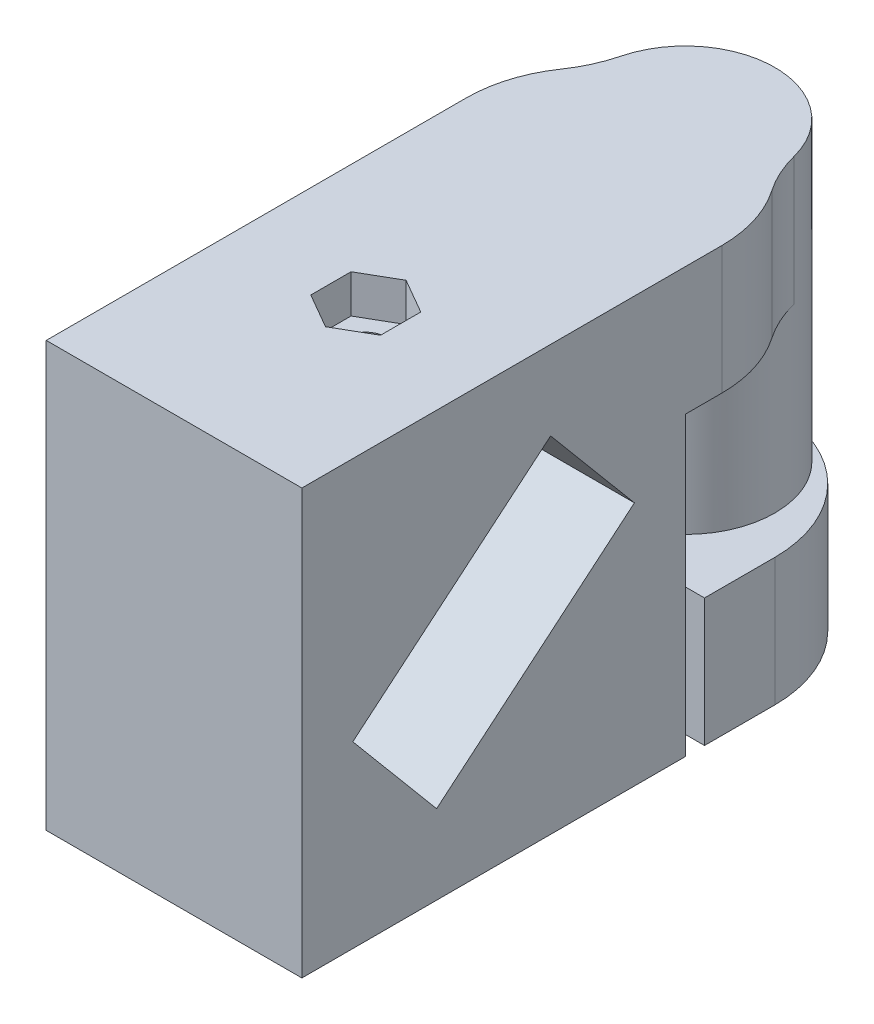
ISO-10303-21;
HEADER;
FILE_DESCRIPTION(('STEP AP214'),'2;1');
FILE_NAME('part.step','',(''),(''),'','','');
FILE_SCHEMA(('AUTOMOTIVE_DESIGN { 1 0 10303 214 1 1 1 1 }'));
ENDSEC;
DATA;
#1=APPLICATION_CONTEXT('core data for automotive mechanical design processes');
#2=APPLICATION_PROTOCOL_DEFINITION('international standard','automotive_design',2000,#1);
#3=PRODUCT_CONTEXT('',#1,'mechanical');
#4=PRODUCT('Part','Part','',(#3));
#5=PRODUCT_RELATED_PRODUCT_CATEGORY('part','',(#4));
#6=PRODUCT_DEFINITION_FORMATION('','',#4);
#7=PRODUCT_DEFINITION_CONTEXT('part definition',#1,'design');
#8=PRODUCT_DEFINITION('design','',#6,#7);
#9=PRODUCT_DEFINITION_SHAPE('','',#8);
#10=(LENGTH_UNIT() NAMED_UNIT(*) SI_UNIT(.MILLI.,.METRE.));
#11=(NAMED_UNIT(*) PLANE_ANGLE_UNIT() SI_UNIT($,.RADIAN.));
#12=(NAMED_UNIT(*) SI_UNIT($,.STERADIAN.) SOLID_ANGLE_UNIT());
#13=UNCERTAINTY_MEASURE_WITH_UNIT(LENGTH_MEASURE(1.E-05),#10,'distance_accuracy_value','');
#14=(GEOMETRIC_REPRESENTATION_CONTEXT(3) GLOBAL_UNCERTAINTY_ASSIGNED_CONTEXT((#13)) GLOBAL_UNIT_ASSIGNED_CONTEXT((#10,
#11,#12)) REPRESENTATION_CONTEXT('',''));
#15=CARTESIAN_POINT('',(0.,0.,0.));
#16=DIRECTION('',(0.,0.,1.));
#17=DIRECTION('',(1.,0.,0.));
#18=AXIS2_PLACEMENT_3D('',#15,#16,#17);
#19=CARTESIAN_POINT('',(0.,0.,0.));
#20=DIRECTION('',(0.,1.,0.));
#21=DIRECTION('',(0.,0.,1.));
#22=AXIS2_PLACEMENT_3D('',#19,#20,#21);
#23=CYLINDRICAL_SURFACE('',#22,1.5);
#24=CARTESIAN_POINT('',(0.,23.2575771755946,0.));
#25=DIRECTION('',(0.,0.766044443118977,0.64278760968654));
#26=DIRECTION('',(0.,0.64278760968654,-0.766044443118977));
#27=AXIS2_PLACEMENT_3D('',#24,#25,#26);
#28=ELLIPSE('',#27,1.95811093399842,1.5);
#29=CARTESIAN_POINT('',(0.,24.5162266223606,-1.5));
#30=VERTEX_POINT('',#29);
#31=EDGE_CURVE('E314',#30,#30,#28,.F.);
#32=ORIENTED_EDGE('',*,*,#31,.T.);
#33=EDGE_LOOP('',(#32));
#34=FACE_BOUND('',#33,.T.);
#35=CARTESIAN_POINT('',(0.,30.2,0.));
#36=DIRECTION('',(0.,1.,0.));
#37=DIRECTION('',(0.,0.,1.));
#38=AXIS2_PLACEMENT_3D('',#35,#36,#37);
#39=CIRCLE('',#38,1.5);
#40=CARTESIAN_POINT('',(0.,30.2,1.5));
#41=VERTEX_POINT('',#40);
#42=EDGE_CURVE('E38',#41,#41,#39,.F.);
#43=ORIENTED_EDGE('',*,*,#42,.F.);
#44=EDGE_LOOP('',(#43));
#45=FACE_BOUND('',#44,.T.);
#46=ADVANCED_FACE('F34',(#34,#45),#23,.F.);
#47=CARTESIAN_POINT('',(0.,9.94242282440537,0.));
#48=DIRECTION('',(0.,-0.766044443118977,-0.64278760968654));
#49=DIRECTION('',(0.,0.64278760968654,-0.766044443118977));
#50=AXIS2_PLACEMENT_3D('',#47,#48,#49);
#51=ELLIPSE('',#50,1.95811093399842,1.5);
#52=CARTESIAN_POINT('',(0.,11.2010722711713,-1.5));
#53=VERTEX_POINT('',#52);
#54=EDGE_CURVE('E324',#53,#53,#51,.F.);
#55=ORIENTED_EDGE('',*,*,#54,.T.);
#56=EDGE_LOOP('',(#55));
#57=FACE_BOUND('',#56,.T.);
#58=CARTESIAN_POINT('',(0.,3.,0.));
#59=DIRECTION('',(0.,-1.,0.));
#60=DIRECTION('',(0.,0.,-1.));
#61=AXIS2_PLACEMENT_3D('',#58,#59,#60);
#62=CIRCLE('',#61,1.5);
#63=CARTESIAN_POINT('',(0.,3.,-1.5));
#64=VERTEX_POINT('',#63);
#65=EDGE_CURVE('E263',#64,#64,#62,.F.);
#66=ORIENTED_EDGE('',*,*,#65,.F.);
#67=EDGE_LOOP('',(#66));
#68=FACE_BOUND('',#67,.T.);
#69=ADVANCED_FACE('F415',(#57,#68),#23,.F.);
#70=CARTESIAN_POINT('',(-10.,33.2,-15.));
#71=DIRECTION('',(0.,0.,1.));
#72=DIRECTION('',(1.,0.,0.));
#73=AXIS2_PLACEMENT_3D('',#70,#71,#72);
#74=PLANE('',#73);
#75=DIRECTION('',(-1.,0.,0.));
#76=VECTOR('',#75,1.);
#77=CARTESIAN_POINT('',(10.,23.2,-15.));
#78=LINE('',#77,#76);
#79=CARTESIAN_POINT('',(10.,23.2,-15.));
#80=VERTEX_POINT('',#79);
#81=CARTESIAN_POINT('',(-10.,23.2,-15.));
#82=VERTEX_POINT('',#81);
#83=EDGE_CURVE('E293',#80,#82,#78,.T.);
#84=ORIENTED_EDGE('',*,*,#83,.F.);
#85=DIRECTION('',(0.,-1.,0.));
#86=VECTOR('',#85,1.);
#87=CARTESIAN_POINT('',(10.,33.2,-15.));
#88=LINE('',#87,#86);
#89=CARTESIAN_POINT('',(10.,0.,-15.));
#90=VERTEX_POINT('',#89);
#91=EDGE_CURVE('E359',#80,#90,#88,.T.);
#92=ORIENTED_EDGE('',*,*,#91,.T.);
#93=DIRECTION('',(-1.,0.,0.));
#94=VECTOR('',#93,1.);
#95=CARTESIAN_POINT('',(-10.,0.,-15.));
#96=LINE('',#95,#94);
#97=CARTESIAN_POINT('',(-10.,0.,-15.));
#98=VERTEX_POINT('',#97);
#99=EDGE_CURVE('E346',#90,#98,#96,.T.);
#100=ORIENTED_EDGE('',*,*,#99,.T.);
#101=DIRECTION('',(0.,-1.,0.));
#102=VECTOR('',#101,1.);
#103=CARTESIAN_POINT('',(-10.,33.2,-15.));
#104=LINE('',#103,#102);
#105=EDGE_CURVE('E357',#82,#98,#104,.T.);
#106=ORIENTED_EDGE('',*,*,#105,.F.);
#107=EDGE_LOOP('',(#84,#92,#100,#106));
#108=FACE_BOUND('',#107,.T.);
#109=ADVANCED_FACE('F417',(#108),#74,.F.);
#110=CARTESIAN_POINT('',(10.,33.2,15.));
#111=DIRECTION('',(-1.,0.,0.));
#112=DIRECTION('',(0.,0.,1.));
#113=AXIS2_PLACEMENT_3D('',#110,#111,#112);
#114=PLANE('',#113);
#115=DIRECTION('',(0.,-0.766044443118977,-0.642787609686541));
#116=VECTOR('',#115,1.);
#117=CARTESIAN_POINT('',(10.,40.2194928800611,6.63449414199771));
#118=LINE('',#117,#116);
#119=CARTESIAN_POINT('',(10.,26.9989815177408,-4.45883206610031));
#120=VERTEX_POINT('',#119);
#121=CARTESIAN_POINT('',(10.,19.1853281979273,-11.015265684903));
#122=VERTEX_POINT('',#121);
#123=EDGE_CURVE('E331',#120,#122,#118,.T.);
#124=ORIENTED_EDGE('',*,*,#123,.T.);
#125=DIRECTION('',(0.,-0.64278760968654,0.766044443118977));
#126=VECTOR('',#125,1.);
#127=CARTESIAN_POINT('',(10.,12.1658353178662,-2.64975982690073));
#128=LINE('',#127,#126);
#129=CARTESIAN_POINT('',(10.,6.20101848225916,4.45883206610031));
#130=VERTEX_POINT('',#129);
#131=EDGE_CURVE('E325',#122,#130,#128,.T.);
#132=ORIENTED_EDGE('',*,*,#131,.T.);
#133=DIRECTION('',(0.,0.766044443118977,0.642787609686541));
#134=VECTOR('',#133,1.);
#135=CARTESIAN_POINT('',(10.,27.235183164393,22.1085918930011));
#136=LINE('',#135,#134);
#137=CARTESIAN_POINT('',(10.,14.0146718020727,11.015265684903));
#138=VERTEX_POINT('',#137);
#139=EDGE_CURVE('E328',#130,#138,#136,.T.);
#140=ORIENTED_EDGE('',*,*,#139,.T.);
#141=DIRECTION('',(0.,0.64278760968654,-0.766044443118977));
#142=VECTOR('',#141,1.);
#143=CARTESIAN_POINT('',(10.,19.9794886376797,3.90667379190198));
#144=LINE('',#143,#142);
#145=EDGE_CURVE('E321',#138,#120,#144,.T.);
#146=ORIENTED_EDGE('',*,*,#145,.T.);
#147=EDGE_LOOP('',(#124,#132,#140,#146));
#148=FACE_BOUND('',#147,.T.);
#149=DIRECTION('',(0.,0.,1.));
#150=VECTOR('',#149,1.);
#151=CARTESIAN_POINT('',(10.,23.2,-25.));
#152=LINE('',#151,#150);
#153=CARTESIAN_POINT('',(10.,23.2,-17.8585715714571));
#154=VERTEX_POINT('',#153);
#155=EDGE_CURVE('E298',#154,#80,#152,.T.);
#156=ORIENTED_EDGE('',*,*,#155,.F.);
#157=DIRECTION('',(0.,1.,0.));
#158=VECTOR('',#157,1.);
#159=CARTESIAN_POINT('',(10.,33.2,-17.8585715714571));
#160=LINE('',#159,#158);
#161=CARTESIAN_POINT('',(10.,33.2,-17.8585715714571));
#162=VERTEX_POINT('',#161);
#163=EDGE_CURVE('E377',#154,#162,#160,.T.);
#164=ORIENTED_EDGE('',*,*,#163,.T.);
#165=DIRECTION('',(0.,0.,-1.));
#166=VECTOR('',#165,1.);
#167=CARTESIAN_POINT('',(10.,33.2,15.));
#168=LINE('',#167,#166);
#169=CARTESIAN_POINT('',(10.,33.2,15.));
#170=VERTEX_POINT('',#169);
#171=EDGE_CURVE('E335',#170,#162,#168,.T.);
#172=ORIENTED_EDGE('',*,*,#171,.F.);
#173=DIRECTION('',(0.,-1.,0.));
#174=VECTOR('',#173,1.);
#175=CARTESIAN_POINT('',(10.,33.2,15.));
#176=LINE('',#175,#174);
#177=CARTESIAN_POINT('',(10.,0.,15.));
#178=VERTEX_POINT('',#177);
#179=EDGE_CURVE('E343',#170,#178,#176,.T.);
#180=ORIENTED_EDGE('',*,*,#179,.T.);
#181=DIRECTION('',(0.,0.,-1.));
#182=VECTOR('',#181,1.);
#183=CARTESIAN_POINT('',(10.,0.,15.));
#184=LINE('',#183,#182);
#185=EDGE_CURVE('E334',#178,#90,#184,.T.);
#186=ORIENTED_EDGE('',*,*,#185,.T.);
#187=ORIENTED_EDGE('',*,*,#91,.F.);
#188=EDGE_LOOP('',(#156,#164,#172,#180,#186,#187));
#189=FACE_BOUND('',#188,.T.);
#190=ADVANCED_FACE('F424',(#148,#189),#114,.F.);
#191=CARTESIAN_POINT('',(-10.,33.2,15.));
#192=DIRECTION('',(1.,0.,0.));
#193=DIRECTION('',(0.,0.,-1.));
#194=AXIS2_PLACEMENT_3D('',#191,#192,#193);
#195=PLANE('',#194);
#196=DIRECTION('',(0.,0.766044443118977,0.642787609686541));
#197=VECTOR('',#196,1.);
#198=CARTESIAN_POINT('',(-10.,14.0146718020727,11.015265684903));
#199=LINE('',#198,#197);
#200=CARTESIAN_POINT('',(-10.,6.20101848225916,4.45883206610032));
#201=VERTEX_POINT('',#200);
#202=CARTESIAN_POINT('',(-10.,14.0146718020727,11.015265684903));
#203=VERTEX_POINT('',#202);
#204=EDGE_CURVE('E302',#201,#203,#199,.T.);
#205=ORIENTED_EDGE('',*,*,#204,.F.);
#206=DIRECTION('',(0.,-0.64278760968654,0.766044443118977));
#207=VECTOR('',#206,1.);
#208=CARTESIAN_POINT('',(-10.,19.1853281979273,-11.015265684903));
#209=LINE('',#208,#207);
#210=CARTESIAN_POINT('',(-10.,19.1853281979273,-11.015265684903));
#211=VERTEX_POINT('',#210);
#212=EDGE_CURVE('E300',#211,#201,#209,.T.);
#213=ORIENTED_EDGE('',*,*,#212,.F.);
#214=DIRECTION('',(0.,-0.766044443118977,-0.642787609686541));
#215=VECTOR('',#214,1.);
#216=CARTESIAN_POINT('',(-10.,26.9989815177408,-4.45883206610031));
#217=LINE('',#216,#215);
#218=CARTESIAN_POINT('',(-10.,26.9989815177408,-4.45883206610031));
#219=VERTEX_POINT('',#218);
#220=EDGE_CURVE('E308',#219,#211,#217,.T.);
#221=ORIENTED_EDGE('',*,*,#220,.F.);
#222=DIRECTION('',(0.,0.64278760968654,-0.766044443118977));
#223=VECTOR('',#222,1.);
#224=CARTESIAN_POINT('',(-10.,26.9989815177408,-4.45883206610031));
#225=LINE('',#224,#223);
#226=EDGE_CURVE('E305',#203,#219,#225,.T.);
#227=ORIENTED_EDGE('',*,*,#226,.F.);
#228=EDGE_LOOP('',(#205,#213,#221,#227));
#229=FACE_BOUND('',#228,.T.);
#230=DIRECTION('',(0.,0.,1.));
#231=VECTOR('',#230,1.);
#232=CARTESIAN_POINT('',(-10.,33.2,15.));
#233=LINE('',#232,#231);
#234=CARTESIAN_POINT('',(-10.,33.2,-17.8585715714571));
#235=VERTEX_POINT('',#234);
#236=CARTESIAN_POINT('',(-10.,33.2,15.));
#237=VERTEX_POINT('',#236);
#238=EDGE_CURVE('E338',#235,#237,#233,.T.);
#239=ORIENTED_EDGE('',*,*,#238,.F.);
#240=DIRECTION('',(0.,1.,0.));
#241=VECTOR('',#240,1.);
#242=CARTESIAN_POINT('',(-10.,33.2,-17.8585715714571));
#243=LINE('',#242,#241);
#244=CARTESIAN_POINT('',(-10.,23.2,-17.8585715714571));
#245=VERTEX_POINT('',#244);
#246=EDGE_CURVE('E370',#235,#245,#243,.F.);
#247=ORIENTED_EDGE('',*,*,#246,.T.);
#248=DIRECTION('',(0.,0.,1.));
#249=VECTOR('',#248,1.);
#250=CARTESIAN_POINT('',(-10.,23.2,-25.));
#251=LINE('',#250,#249);
#252=EDGE_CURVE('E296',#245,#82,#251,.T.);
#253=ORIENTED_EDGE('',*,*,#252,.T.);
#254=ORIENTED_EDGE('',*,*,#105,.T.);
#255=DIRECTION('',(0.,0.,1.));
#256=VECTOR('',#255,1.);
#257=CARTESIAN_POINT('',(-10.,0.,15.));
#258=LINE('',#257,#256);
#259=CARTESIAN_POINT('',(-10.,0.,15.));
#260=VERTEX_POINT('',#259);
#261=EDGE_CURVE('E349',#98,#260,#258,.T.);
#262=ORIENTED_EDGE('',*,*,#261,.T.);
#263=DIRECTION('',(0.,-1.,0.));
#264=VECTOR('',#263,1.);
#265=CARTESIAN_POINT('',(-10.,33.2,15.));
#266=LINE('',#265,#264);
#267=EDGE_CURVE('E354',#237,#260,#266,.T.);
#268=ORIENTED_EDGE('',*,*,#267,.F.);
#269=EDGE_LOOP('',(#239,#247,#253,#254,#262,#268));
#270=FACE_BOUND('',#269,.T.);
#271=ADVANCED_FACE('F444',(#229,#270),#195,.F.);
#272=CARTESIAN_POINT('',(-10.,33.2,15.));
#273=DIRECTION('',(0.,0.,-1.));
#274=DIRECTION('',(-1.,0.,0.));
#275=AXIS2_PLACEMENT_3D('',#272,#273,#274);
#276=PLANE('',#275);
#277=DIRECTION('',(1.,0.,0.));
#278=VECTOR('',#277,1.);
#279=CARTESIAN_POINT('',(-10.,0.,15.));
#280=LINE('',#279,#278);
#281=EDGE_CURVE('E339',#260,#178,#280,.T.);
#282=ORIENTED_EDGE('',*,*,#281,.T.);
#283=ORIENTED_EDGE('',*,*,#179,.F.);
#284=DIRECTION('',(1.,0.,0.));
#285=VECTOR('',#284,1.);
#286=CARTESIAN_POINT('',(-10.,33.2,15.));
#287=LINE('',#286,#285);
#288=EDGE_CURVE('E341',#237,#170,#287,.T.);
#289=ORIENTED_EDGE('',*,*,#288,.F.);
#290=ORIENTED_EDGE('',*,*,#267,.T.);
#291=EDGE_LOOP('',(#282,#283,#289,#290));
#292=FACE_BOUND('',#291,.T.);
#293=ADVANCED_FACE('F436',(#292),#276,.F.);
#294=CARTESIAN_POINT('',(0.,33.2,0.));
#295=DIRECTION('',(0.,-1.,0.));
#296=DIRECTION('',(0.,0.,-1.));
#297=AXIS2_PLACEMENT_3D('',#294,#295,#296);
#298=PLANE('',#297);
#299=DIRECTION('',(-0.866025403784439,0.,0.5));
#300=VECTOR('',#299,1.);
#301=CARTESIAN_POINT('',(0.,33.2,-3.15));
#302=LINE('',#301,#300);
#303=CARTESIAN_POINT('',(0.,33.2,-3.15));
#304=VERTEX_POINT('',#303);
#305=CARTESIAN_POINT('',(-2.72798002192098,33.2,-1.575));
#306=VERTEX_POINT('',#305);
#307=EDGE_CURVE('E241',#304,#306,#302,.T.);
#308=ORIENTED_EDGE('',*,*,#307,.F.);
#309=DIRECTION('',(-0.866025403784438,0.,-0.5));
#310=VECTOR('',#309,1.);
#311=CARTESIAN_POINT('',(2.72798002192098,33.2,-1.575));
#312=LINE('',#311,#310);
#313=CARTESIAN_POINT('',(2.72798002192098,33.2,-1.575));
#314=VERTEX_POINT('',#313);
#315=EDGE_CURVE('E51',#314,#304,#312,.T.);
#316=ORIENTED_EDGE('',*,*,#315,.F.);
#317=DIRECTION('',(0.,0.,-1.));
#318=VECTOR('',#317,1.);
#319=CARTESIAN_POINT('',(2.72798002192098,33.2,1.575));
#320=LINE('',#319,#318);
#321=CARTESIAN_POINT('',(2.72798002192098,33.2,1.575));
#322=VERTEX_POINT('',#321);
#323=EDGE_CURVE('E227',#322,#314,#320,.T.);
#324=ORIENTED_EDGE('',*,*,#323,.F.);
#325=DIRECTION('',(0.866025403784438,0.,-0.5));
#326=VECTOR('',#325,1.);
#327=CARTESIAN_POINT('',(0.,33.2,3.15));
#328=LINE('',#327,#326);
#329=CARTESIAN_POINT('',(0.,33.2,3.15));
#330=VERTEX_POINT('',#329);
#331=EDGE_CURVE('E230',#330,#322,#328,.T.);
#332=ORIENTED_EDGE('',*,*,#331,.F.);
#333=DIRECTION('',(0.866025403784438,0.,0.5));
#334=VECTOR('',#333,1.);
#335=CARTESIAN_POINT('',(-2.72798002192098,33.2,1.575));
#336=LINE('',#335,#334);
#337=CARTESIAN_POINT('',(-2.72798002192098,33.2,1.575));
#338=VERTEX_POINT('',#337);
#339=EDGE_CURVE('E246',#338,#330,#336,.T.);
#340=ORIENTED_EDGE('',*,*,#339,.F.);
#341=DIRECTION('',(0.,0.,1.));
#342=VECTOR('',#341,1.);
#343=CARTESIAN_POINT('',(-2.72798002192098,33.2,-1.575));
#344=LINE('',#343,#342);
#345=EDGE_CURVE('E243',#306,#338,#344,.T.);
#346=ORIENTED_EDGE('',*,*,#345,.F.);
#347=EDGE_LOOP('',(#308,#316,#324,#332,#340,#346));
#348=FACE_BOUND('',#347,.T.);
#349=CARTESIAN_POINT('',(0.,33.2,-17.8585715714571));
#350=DIRECTION('',(0.,-1.,0.));
#351=DIRECTION('',(0.,0.,-1.));
#352=AXIS2_PLACEMENT_3D('',#349,#350,#351);
#353=CIRCLE('',#352,10.);
#354=CARTESIAN_POINT('',(8.23639698497575,33.2,-23.5297059117706));
#355=VERTEX_POINT('',#354);
#356=EDGE_CURVE('E361',#162,#355,#353,.F.);
#357=ORIENTED_EDGE('',*,*,#356,.T.);
#358=CARTESIAN_POINT('',(16.4727939699515,33.2,-29.200840252084));
#359=DIRECTION('',(0.,-1.,0.));
#360=DIRECTION('',(0.,0.,-1.));
#361=AXIS2_PLACEMENT_3D('',#358,#359,#360);
#362=CIRCLE('',#361,10.);
#363=CARTESIAN_POINT('',(6.78291516409768,33.2,-26.7297577508581));
#364=VERTEX_POINT('',#363);
#365=EDGE_CURVE('E406',#355,#364,#362,.T.);
#366=ORIENTED_EDGE('',*,*,#365,.T.);
#367=CARTESIAN_POINT('',(0.,33.2,-25.));
#368=DIRECTION('',(0.,-1.,0.));
#369=DIRECTION('',(0.,0.,-1.));
#370=AXIS2_PLACEMENT_3D('',#367,#368,#369);
#371=CIRCLE('',#370,7.);
#372=CARTESIAN_POINT('',(-6.78291516409768,33.2,-26.7297577508581));
#373=VERTEX_POINT('',#372);
#374=EDGE_CURVE('E286',#364,#373,#371,.F.);
#375=ORIENTED_EDGE('',*,*,#374,.T.);
#376=CARTESIAN_POINT('',(-16.4727939699515,33.2,-29.200840252084));
#377=DIRECTION('',(0.,-1.,0.));
#378=DIRECTION('',(0.,0.,-1.));
#379=AXIS2_PLACEMENT_3D('',#376,#377,#378);
#380=CIRCLE('',#379,10.);
#381=CARTESIAN_POINT('',(-8.23639698497575,33.2,-23.5297059117706));
#382=VERTEX_POINT('',#381);
#383=EDGE_CURVE('E43',#373,#382,#380,.T.);
#384=ORIENTED_EDGE('',*,*,#383,.T.);
#385=CARTESIAN_POINT('',(0.,33.2,-17.8585715714571));
#386=DIRECTION('',(0.,-1.,0.));
#387=DIRECTION('',(0.,0.,-1.));
#388=AXIS2_PLACEMENT_3D('',#385,#386,#387);
#389=CIRCLE('',#388,10.);
#390=EDGE_CURVE('E368',#382,#235,#389,.F.);
#391=ORIENTED_EDGE('',*,*,#390,.T.);
#392=ORIENTED_EDGE('',*,*,#238,.T.);
#393=ORIENTED_EDGE('',*,*,#288,.T.);
#394=ORIENTED_EDGE('',*,*,#171,.T.);
#395=EDGE_LOOP('',(#357,#366,#375,#384,#391,#392,#393,#394));
#396=FACE_BOUND('',#395,.T.);
#397=ADVANCED_FACE('F432',(#348,#396),#298,.F.);
#398=CARTESIAN_POINT('',(0.,0.,0.));
#399=DIRECTION('',(0.,-1.,0.));
#400=DIRECTION('',(0.,0.,-1.));
#401=AXIS2_PLACEMENT_3D('',#398,#399,#400);
#402=PLANE('',#401);
#403=CARTESIAN_POINT('',(0.,0.,0.));
#404=DIRECTION('',(0.,-1.,0.));
#405=DIRECTION('',(0.,0.,-1.));
#406=AXIS2_PLACEMENT_3D('',#403,#404,#405);
#407=CIRCLE('',#406,3.15);
#408=CARTESIAN_POINT('',(0.,0.,-3.15));
#409=VERTEX_POINT('',#408);
#410=EDGE_CURVE('E264',#409,#409,#407,.T.);
#411=ORIENTED_EDGE('',*,*,#410,.F.);
#412=EDGE_LOOP('',(#411));
#413=FACE_BOUND('',#412,.T.);
#414=ORIENTED_EDGE('',*,*,#185,.F.);
#415=ORIENTED_EDGE('',*,*,#281,.F.);
#416=ORIENTED_EDGE('',*,*,#261,.F.);
#417=ORIENTED_EDGE('',*,*,#99,.F.);
#418=EDGE_LOOP('',(#414,#415,#416,#417));
#419=FACE_BOUND('',#418,.T.);
#420=ADVANCED_FACE('F435',(#413,#419),#402,.T.);
#421=CARTESIAN_POINT('',(20.,26.9989815177408,-4.45883206610031));
#422=DIRECTION('',(0.,0.642787609686541,-0.766044443118977));
#423=DIRECTION('',(0.,0.766044443118977,0.642787609686541));
#424=AXIS2_PLACEMENT_3D('',#421,#422,#423);
#425=PLANE('',#424);
#426=DIRECTION('',(-1.,0.,0.));
#427=VECTOR('',#426,1.);
#428=CARTESIAN_POINT('',(20.,26.9989815177408,-4.45883206610031));
#429=LINE('',#428,#427);
#430=EDGE_CURVE('E315',#120,#219,#429,.T.);
#431=ORIENTED_EDGE('',*,*,#430,.T.);
#432=ORIENTED_EDGE('',*,*,#220,.T.);
#433=DIRECTION('',(-1.,0.,0.));
#434=VECTOR('',#433,1.);
#435=CARTESIAN_POINT('',(20.,19.1853281979273,-11.015265684903));
#436=LINE('',#435,#434);
#437=EDGE_CURVE('E312',#122,#211,#436,.T.);
#438=ORIENTED_EDGE('',*,*,#437,.F.);
#439=ORIENTED_EDGE('',*,*,#123,.F.);
#440=EDGE_LOOP('',(#431,#432,#438,#439));
#441=FACE_BOUND('',#440,.T.);
#442=ADVANCED_FACE('F440',(#441),#425,.F.);
#443=CARTESIAN_POINT('',(20.,14.0146718020727,11.015265684903));
#444=DIRECTION('',(0.,-0.642787609686541,0.766044443118977));
#445=DIRECTION('',(0.,-0.766044443118977,-0.642787609686541));
#446=AXIS2_PLACEMENT_3D('',#443,#444,#445);
#447=PLANE('',#446);
#448=DIRECTION('',(-1.,0.,0.));
#449=VECTOR('',#448,1.);
#450=CARTESIAN_POINT('',(20.,6.20101848225916,4.45883206610031));
#451=LINE('',#450,#449);
#452=EDGE_CURVE('E311',#130,#201,#451,.T.);
#453=ORIENTED_EDGE('',*,*,#452,.T.);
#454=ORIENTED_EDGE('',*,*,#204,.T.);
#455=DIRECTION('',(-1.,0.,0.));
#456=VECTOR('',#455,1.);
#457=CARTESIAN_POINT('',(20.,14.0146718020727,11.015265684903));
#458=LINE('',#457,#456);
#459=EDGE_CURVE('E317',#138,#203,#458,.T.);
#460=ORIENTED_EDGE('',*,*,#459,.F.);
#461=ORIENTED_EDGE('',*,*,#139,.F.);
#462=EDGE_LOOP('',(#453,#454,#460,#461));
#463=FACE_BOUND('',#462,.T.);
#464=ADVANCED_FACE('F522',(#463),#447,.F.);
#465=CARTESIAN_POINT('',(20.,19.1853281979273,-11.015265684903));
#466=DIRECTION('',(0.,-0.766044443118977,-0.64278760968654));
#467=DIRECTION('',(0.,0.64278760968654,-0.766044443118977));
#468=AXIS2_PLACEMENT_3D('',#465,#466,#467);
#469=PLANE('',#468);
#470=ORIENTED_EDGE('',*,*,#54,.F.);
#471=EDGE_LOOP('',(#470));
#472=FACE_BOUND('',#471,.T.);
#473=ORIENTED_EDGE('',*,*,#437,.T.);
#474=ORIENTED_EDGE('',*,*,#212,.T.);
#475=ORIENTED_EDGE('',*,*,#452,.F.);
#476=ORIENTED_EDGE('',*,*,#131,.F.);
#477=EDGE_LOOP('',(#473,#474,#475,#476));
#478=FACE_BOUND('',#477,.T.);
#479=ADVANCED_FACE('F430',(#472,#478),#469,.F.);
#480=CARTESIAN_POINT('',(20.,26.9989815177408,-4.45883206610031));
#481=DIRECTION('',(0.,0.766044443118977,0.64278760968654));
#482=DIRECTION('',(0.,-0.64278760968654,0.766044443118977));
#483=AXIS2_PLACEMENT_3D('',#480,#481,#482);
#484=PLANE('',#483);
#485=ORIENTED_EDGE('',*,*,#31,.F.);
#486=EDGE_LOOP('',(#485));
#487=FACE_BOUND('',#486,.T.);
#488=ORIENTED_EDGE('',*,*,#459,.T.);
#489=ORIENTED_EDGE('',*,*,#226,.T.);
#490=ORIENTED_EDGE('',*,*,#430,.F.);
#491=ORIENTED_EDGE('',*,*,#145,.F.);
#492=EDGE_LOOP('',(#488,#489,#490,#491));
#493=FACE_BOUND('',#492,.T.);
#494=ADVANCED_FACE('F518',(#487,#493),#484,.F.);
#495=CARTESIAN_POINT('',(10.,23.2,-25.));
#496=DIRECTION('',(0.,1.,0.));
#497=DIRECTION('',(0.,0.,1.));
#498=AXIS2_PLACEMENT_3D('',#495,#496,#497);
#499=PLANE('',#498);
#500=ORIENTED_EDGE('',*,*,#252,.F.);
#501=CARTESIAN_POINT('',(0.,23.2,-17.8585715714571));
#502=DIRECTION('',(0.,1.,0.));
#503=DIRECTION('',(0.,0.,1.));
#504=AXIS2_PLACEMENT_3D('',#501,#502,#503);
#505=CIRCLE('',#504,10.);
#506=CARTESIAN_POINT('',(-8.23639698497575,23.2,-23.5297059117706));
#507=VERTEX_POINT('',#506);
#508=EDGE_CURVE('E374',#245,#507,#505,.F.);
#509=ORIENTED_EDGE('',*,*,#508,.T.);
#510=CARTESIAN_POINT('',(-16.4727939699515,23.2,-29.200840252084));
#511=DIRECTION('',(0.,1.,0.));
#512=DIRECTION('',(0.,0.,1.));
#513=AXIS2_PLACEMENT_3D('',#510,#511,#512);
#514=CIRCLE('',#513,10.);
#515=CARTESIAN_POINT('',(-6.78291516409768,23.2,-26.7297577508581));
#516=VERTEX_POINT('',#515);
#517=EDGE_CURVE('E11',#507,#516,#514,.T.);
#518=ORIENTED_EDGE('',*,*,#517,.T.);
#519=CARTESIAN_POINT('',(0.,23.2,-25.));
#520=DIRECTION('',(0.,1.,0.));
#521=DIRECTION('',(0.,0.,1.));
#522=AXIS2_PLACEMENT_3D('',#519,#520,#521);
#523=CIRCLE('',#522,7.);
#524=CARTESIAN_POINT('',(6.78291516409768,23.2,-26.7297577508581));
#525=VERTEX_POINT('',#524);
#526=EDGE_CURVE('E291',#525,#516,#523,.F.);
#527=ORIENTED_EDGE('',*,*,#526,.F.);
#528=CARTESIAN_POINT('',(16.4727939699515,23.2,-29.200840252084));
#529=DIRECTION('',(0.,1.,0.));
#530=DIRECTION('',(0.,0.,1.));
#531=AXIS2_PLACEMENT_3D('',#528,#529,#530);
#532=CIRCLE('',#531,10.);
#533=CARTESIAN_POINT('',(8.23639698497575,23.2,-23.5297059117706));
#534=VERTEX_POINT('',#533);
#535=EDGE_CURVE('E404',#525,#534,#532,.T.);
#536=ORIENTED_EDGE('',*,*,#535,.T.);
#537=CARTESIAN_POINT('',(0.,23.2,-17.8585715714571));
#538=DIRECTION('',(0.,1.,0.));
#539=DIRECTION('',(0.,0.,1.));
#540=AXIS2_PLACEMENT_3D('',#537,#538,#539);
#541=CIRCLE('',#540,10.);
#542=EDGE_CURVE('E372',#534,#154,#541,.F.);
#543=ORIENTED_EDGE('',*,*,#542,.T.);
#544=ORIENTED_EDGE('',*,*,#155,.T.);
#545=ORIENTED_EDGE('',*,*,#83,.T.);
#546=EDGE_LOOP('',(#500,#509,#518,#527,#536,#543,#544,#545));
#547=FACE_BOUND('',#546,.T.);
#548=ADVANCED_FACE('F512',(#547),#499,.F.);
#549=CARTESIAN_POINT('',(0.,-19.7989898732233,-25.));
#550=DIRECTION('',(0.,1.,0.));
#551=DIRECTION('',(0.,0.,1.));
#552=AXIS2_PLACEMENT_3D('',#549,#550,#551);
#553=CYLINDRICAL_SURFACE('',#552,7.);
#554=CARTESIAN_POINT('',(0.,10.,-25.));
#555=DIRECTION('',(0.,1.,0.));
#556=DIRECTION('',(0.,0.,1.));
#557=AXIS2_PLACEMENT_3D('',#554,#555,#556);
#558=CIRCLE('',#557,7.);
#559=CARTESIAN_POINT('',(0.,10.,-32.));
#560=VERTEX_POINT('',#559);
#561=EDGE_CURVE('E379',#560,#560,#558,.T.);
#562=ORIENTED_EDGE('',*,*,#561,.T.);
#563=EDGE_LOOP('',(#562));
#564=FACE_BOUND('',#563,.T.);
#565=ORIENTED_EDGE('',*,*,#374,.F.);
#566=DIRECTION('',(0.,1.,0.));
#567=VECTOR('',#566,1.);
#568=CARTESIAN_POINT('',(6.78291516409767,-19.7989898732233,-26.7297577508581));
#569=LINE('',#568,#567);
#570=EDGE_CURVE('E385',#364,#525,#569,.F.);
#571=ORIENTED_EDGE('',*,*,#570,.T.);
#572=ORIENTED_EDGE('',*,*,#526,.T.);
#573=DIRECTION('',(0.,1.,0.));
#574=VECTOR('',#573,1.);
#575=CARTESIAN_POINT('',(-6.78291516409768,-19.7989898732233,-26.7297577508581));
#576=LINE('',#575,#574);
#577=EDGE_CURVE('E382',#516,#373,#576,.T.);
#578=ORIENTED_EDGE('',*,*,#577,.T.);
#579=EDGE_LOOP('',(#565,#571,#572,#578));
#580=FACE_BOUND('',#579,.T.);
#581=ADVANCED_FACE('F456',(#564,#580),#553,.T.);
#582=CARTESIAN_POINT('',(0.,-19.7989898732233,-17.8585715714571));
#583=DIRECTION('',(0.,1.,0.));
#584=DIRECTION('',(0.,0.,1.));
#585=AXIS2_PLACEMENT_3D('',#582,#583,#584);
#586=CYLINDRICAL_SURFACE('',#585,10.);
#587=ORIENTED_EDGE('',*,*,#390,.F.);
#588=DIRECTION('',(0.,1.,0.));
#589=VECTOR('',#588,1.);
#590=CARTESIAN_POINT('',(-8.23639698497575,-19.7989898732233,-23.5297059117706));
#591=LINE('',#590,#589);
#592=EDGE_CURVE('E390',#382,#507,#591,.F.);
#593=ORIENTED_EDGE('',*,*,#592,.T.);
#594=ORIENTED_EDGE('',*,*,#508,.F.);
#595=ORIENTED_EDGE('',*,*,#246,.F.);
#596=EDGE_LOOP('',(#587,#593,#594,#595));
#597=FACE_BOUND('',#596,.T.);
#598=ADVANCED_FACE('F452',(#597),#586,.T.);
#599=CARTESIAN_POINT('',(0.,-19.7989898732233,-17.8585715714571));
#600=DIRECTION('',(0.,1.,0.));
#601=DIRECTION('',(0.,0.,1.));
#602=AXIS2_PLACEMENT_3D('',#599,#600,#601);
#603=CYLINDRICAL_SURFACE('',#602,10.);
#604=ORIENTED_EDGE('',*,*,#542,.F.);
#605=DIRECTION('',(0.,1.,0.));
#606=VECTOR('',#605,1.);
#607=CARTESIAN_POINT('',(8.23639698497575,-19.7989898732233,-23.5297059117706));
#608=LINE('',#607,#606);
#609=EDGE_CURVE('E388',#534,#355,#608,.T.);
#610=ORIENTED_EDGE('',*,*,#609,.T.);
#611=ORIENTED_EDGE('',*,*,#356,.F.);
#612=ORIENTED_EDGE('',*,*,#163,.F.);
#613=EDGE_LOOP('',(#604,#610,#611,#612));
#614=FACE_BOUND('',#613,.T.);
#615=ADVANCED_FACE('F455',(#614),#603,.T.);
#616=CARTESIAN_POINT('',(10.,10.,-32.));
#617=DIRECTION('',(1.,0.,0.));
#618=DIRECTION('',(0.,0.,-1.));
#619=AXIS2_PLACEMENT_3D('',#616,#617,#618);
#620=PLANE('',#619);
#621=DIRECTION('',(0.,0.,1.));
#622=VECTOR('',#621,1.);
#623=CARTESIAN_POINT('',(10.,0.,-32.));
#624=LINE('',#623,#622);
#625=CARTESIAN_POINT('',(10.,0.,-22.));
#626=VERTEX_POINT('',#625);
#627=CARTESIAN_POINT('',(10.,0.,-16.5));
#628=VERTEX_POINT('',#627);
#629=EDGE_CURVE('E276',#626,#628,#624,.T.);
#630=ORIENTED_EDGE('',*,*,#629,.F.);
#631=DIRECTION('',(0.,-1.,0.));
#632=VECTOR('',#631,1.);
#633=CARTESIAN_POINT('',(10.,10.,-22.));
#634=LINE('',#633,#632);
#635=CARTESIAN_POINT('',(10.,10.,-22.));
#636=VERTEX_POINT('',#635);
#637=EDGE_CURVE('E396',#626,#636,#634,.F.);
#638=ORIENTED_EDGE('',*,*,#637,.T.);
#639=DIRECTION('',(0.,0.,1.));
#640=VECTOR('',#639,1.);
#641=CARTESIAN_POINT('',(10.,10.,-32.));
#642=LINE('',#641,#640);
#643=CARTESIAN_POINT('',(10.,10.,-16.5));
#644=VERTEX_POINT('',#643);
#645=EDGE_CURVE('E267',#636,#644,#642,.T.);
#646=ORIENTED_EDGE('',*,*,#645,.T.);
#647=DIRECTION('',(0.,-1.,0.));
#648=VECTOR('',#647,1.);
#649=CARTESIAN_POINT('',(10.,10.,-16.5));
#650=LINE('',#649,#648);
#651=EDGE_CURVE('E275',#644,#628,#650,.T.);
#652=ORIENTED_EDGE('',*,*,#651,.T.);
#653=EDGE_LOOP('',(#630,#638,#646,#652));
#654=FACE_BOUND('',#653,.T.);
#655=ADVANCED_FACE('F460',(#654),#620,.T.);
#656=CARTESIAN_POINT('',(-10.,10.,-32.));
#657=DIRECTION('',(-1.,0.,0.));
#658=DIRECTION('',(0.,0.,1.));
#659=AXIS2_PLACEMENT_3D('',#656,#657,#658);
#660=PLANE('',#659);
#661=DIRECTION('',(0.,0.,-1.));
#662=VECTOR('',#661,1.);
#663=CARTESIAN_POINT('',(-10.,10.,-32.));
#664=LINE('',#663,#662);
#665=CARTESIAN_POINT('',(-10.,10.,-16.5));
#666=VERTEX_POINT('',#665);
#667=CARTESIAN_POINT('',(-10.,10.,-22.));
#668=VERTEX_POINT('',#667);
#669=EDGE_CURVE('E273',#666,#668,#664,.T.);
#670=ORIENTED_EDGE('',*,*,#669,.T.);
#671=DIRECTION('',(0.,-1.,0.));
#672=VECTOR('',#671,1.);
#673=CARTESIAN_POINT('',(-10.,10.,-22.));
#674=LINE('',#673,#672);
#675=CARTESIAN_POINT('',(-10.,0.,-22.));
#676=VERTEX_POINT('',#675);
#677=EDGE_CURVE('E402',#668,#676,#674,.T.);
#678=ORIENTED_EDGE('',*,*,#677,.T.);
#679=DIRECTION('',(0.,0.,-1.));
#680=VECTOR('',#679,1.);
#681=CARTESIAN_POINT('',(-10.,0.,-32.));
#682=LINE('',#681,#680);
#683=CARTESIAN_POINT('',(-10.,0.,-16.5));
#684=VERTEX_POINT('',#683);
#685=EDGE_CURVE('E270',#684,#676,#682,.T.);
#686=ORIENTED_EDGE('',*,*,#685,.F.);
#687=DIRECTION('',(0.,-1.,0.));
#688=VECTOR('',#687,1.);
#689=CARTESIAN_POINT('',(-10.,10.,-16.5));
#690=LINE('',#689,#688);
#691=EDGE_CURVE('E284',#666,#684,#690,.T.);
#692=ORIENTED_EDGE('',*,*,#691,.F.);
#693=EDGE_LOOP('',(#670,#678,#686,#692));
#694=FACE_BOUND('',#693,.T.);
#695=ADVANCED_FACE('F498',(#694),#660,.T.);
#696=CARTESIAN_POINT('',(-10.,10.,-16.5));
#697=DIRECTION('',(0.,0.,1.));
#698=DIRECTION('',(1.,0.,0.));
#699=AXIS2_PLACEMENT_3D('',#696,#697,#698);
#700=PLANE('',#699);
#701=DIRECTION('',(-1.,0.,0.));
#702=VECTOR('',#701,1.);
#703=CARTESIAN_POINT('',(-10.,0.,-16.5));
#704=LINE('',#703,#702);
#705=EDGE_CURVE('E278',#628,#684,#704,.T.);
#706=ORIENTED_EDGE('',*,*,#705,.F.);
#707=ORIENTED_EDGE('',*,*,#651,.F.);
#708=DIRECTION('',(-1.,0.,0.));
#709=VECTOR('',#708,1.);
#710=CARTESIAN_POINT('',(-10.,10.,-16.5));
#711=LINE('',#710,#709);
#712=EDGE_CURVE('E269',#644,#666,#711,.T.);
#713=ORIENTED_EDGE('',*,*,#712,.T.);
#714=ORIENTED_EDGE('',*,*,#691,.T.);
#715=EDGE_LOOP('',(#706,#707,#713,#714));
#716=FACE_BOUND('',#715,.T.);
#717=ADVANCED_FACE('F492',(#716),#700,.T.);
#718=CARTESIAN_POINT('',(0.,10.,0.));
#719=DIRECTION('',(0.,1.,0.));
#720=DIRECTION('',(0.,0.,1.));
#721=AXIS2_PLACEMENT_3D('',#718,#719,#720);
#722=PLANE('',#721);
#723=ORIENTED_EDGE('',*,*,#645,.F.);
#724=CARTESIAN_POINT('',(0.,10.,-22.));
#725=DIRECTION('',(0.,1.,0.));
#726=DIRECTION('',(0.,0.,1.));
#727=AXIS2_PLACEMENT_3D('',#724,#725,#726);
#728=CIRCLE('',#727,10.);
#729=EDGE_CURVE('E400',#636,#560,#728,.T.);
#730=ORIENTED_EDGE('',*,*,#729,.T.);
#731=ORIENTED_EDGE('',*,*,#561,.F.);
#732=CARTESIAN_POINT('',(0.,10.,-22.));
#733=DIRECTION('',(0.,1.,0.));
#734=DIRECTION('',(0.,0.,1.));
#735=AXIS2_PLACEMENT_3D('',#732,#733,#734);
#736=CIRCLE('',#735,10.);
#737=EDGE_CURVE('E59',#560,#668,#736,.T.);
#738=ORIENTED_EDGE('',*,*,#737,.T.);
#739=ORIENTED_EDGE('',*,*,#669,.F.);
#740=ORIENTED_EDGE('',*,*,#712,.F.);
#741=EDGE_LOOP('',(#723,#730,#731,#738,#739,#740));
#742=FACE_BOUND('',#741,.T.);
#743=ADVANCED_FACE('F489',(#742),#722,.T.);
#744=CARTESIAN_POINT('',(0.,0.,0.));
#745=DIRECTION('',(0.,-1.,0.));
#746=DIRECTION('',(0.,0.,-1.));
#747=AXIS2_PLACEMENT_3D('',#744,#745,#746);
#748=PLANE('',#747);
#749=CARTESIAN_POINT('',(0.,0.,-22.));
#750=DIRECTION('',(0.,-1.,0.));
#751=DIRECTION('',(0.,0.,-1.));
#752=AXIS2_PLACEMENT_3D('',#749,#750,#751);
#753=CIRCLE('',#752,10.);
#754=CARTESIAN_POINT('',(0.,0.,-32.));
#755=VERTEX_POINT('',#754);
#756=EDGE_CURVE('E392',#676,#755,#753,.T.);
#757=ORIENTED_EDGE('',*,*,#756,.T.);
#758=CARTESIAN_POINT('',(0.,0.,-22.));
#759=DIRECTION('',(0.,-1.,0.));
#760=DIRECTION('',(0.,0.,-1.));
#761=AXIS2_PLACEMENT_3D('',#758,#759,#760);
#762=CIRCLE('',#761,10.);
#763=EDGE_CURVE('E394',#755,#626,#762,.T.);
#764=ORIENTED_EDGE('',*,*,#763,.T.);
#765=ORIENTED_EDGE('',*,*,#629,.T.);
#766=ORIENTED_EDGE('',*,*,#705,.T.);
#767=ORIENTED_EDGE('',*,*,#685,.T.);
#768=EDGE_LOOP('',(#757,#764,#765,#766,#767));
#769=FACE_BOUND('',#768,.T.);
#770=ADVANCED_FACE('F466',(#769),#748,.T.);
#771=CARTESIAN_POINT('',(16.4727939699515,-19.7989898732233,-29.200840252084));
#772=DIRECTION('',(0.,1.,0.));
#773=DIRECTION('',(0.,0.,1.));
#774=AXIS2_PLACEMENT_3D('',#771,#772,#773);
#775=CYLINDRICAL_SURFACE('',#774,10.);
#776=ORIENTED_EDGE('',*,*,#365,.F.);
#777=ORIENTED_EDGE('',*,*,#609,.F.);
#778=ORIENTED_EDGE('',*,*,#535,.F.);
#779=ORIENTED_EDGE('',*,*,#570,.F.);
#780=EDGE_LOOP('',(#776,#777,#778,#779));
#781=FACE_BOUND('',#780,.T.);
#782=ADVANCED_FACE('F462',(#781),#775,.F.);
#783=CARTESIAN_POINT('',(-16.4727939699515,-19.7989898732233,-29.200840252084));
#784=DIRECTION('',(0.,-1.,0.));
#785=DIRECTION('',(0.,0.,-1.));
#786=AXIS2_PLACEMENT_3D('',#783,#784,#785);
#787=CYLINDRICAL_SURFACE('',#786,10.);
#788=ORIENTED_EDGE('',*,*,#517,.F.);
#789=ORIENTED_EDGE('',*,*,#592,.F.);
#790=ORIENTED_EDGE('',*,*,#383,.F.);
#791=ORIENTED_EDGE('',*,*,#577,.F.);
#792=EDGE_LOOP('',(#788,#789,#790,#791));
#793=FACE_BOUND('',#792,.T.);
#794=ADVANCED_FACE('F465',(#793),#787,.F.);
#795=CARTESIAN_POINT('',(0.,10.,-22.));
#796=DIRECTION('',(0.,-1.,0.));
#797=DIRECTION('',(0.,0.,-1.));
#798=AXIS2_PLACEMENT_3D('',#795,#796,#797);
#799=CYLINDRICAL_SURFACE('',#798,10.);
#800=ORIENTED_EDGE('',*,*,#677,.F.);
#801=ORIENTED_EDGE('',*,*,#737,.F.);
#802=DIRECTION('',(0.,-1.,0.));
#803=VECTOR('',#802,1.);
#804=CARTESIAN_POINT('',(0.,10.,-32.));
#805=LINE('',#804,#803);
#806=EDGE_CURVE('E279',#755,#560,#805,.F.);
#807=ORIENTED_EDGE('',*,*,#806,.F.);
#808=ORIENTED_EDGE('',*,*,#756,.F.);
#809=EDGE_LOOP('',(#800,#801,#807,#808));
#810=FACE_BOUND('',#809,.T.);
#811=ADVANCED_FACE('F36',(#810),#799,.T.);
#812=CARTESIAN_POINT('',(0.,10.,-22.));
#813=DIRECTION('',(0.,-1.,0.));
#814=DIRECTION('',(0.,0.,-1.));
#815=AXIS2_PLACEMENT_3D('',#812,#813,#814);
#816=CYLINDRICAL_SURFACE('',#815,10.);
#817=ORIENTED_EDGE('',*,*,#729,.F.);
#818=ORIENTED_EDGE('',*,*,#637,.F.);
#819=ORIENTED_EDGE('',*,*,#763,.F.);
#820=ORIENTED_EDGE('',*,*,#806,.T.);
#821=EDGE_LOOP('',(#817,#818,#819,#820));
#822=FACE_BOUND('',#821,.T.);
#823=ADVANCED_FACE('F470',(#822),#816,.T.);
#824=CARTESIAN_POINT('',(0.,3.,0.));
#825=DIRECTION('',(0.,-1.,0.));
#826=DIRECTION('',(0.,0.,-1.));
#827=AXIS2_PLACEMENT_3D('',#824,#825,#826);
#828=PLANE('',#827);
#829=CARTESIAN_POINT('',(0.,3.,0.));
#830=DIRECTION('',(0.,-1.,0.));
#831=DIRECTION('',(0.,0.,-1.));
#832=AXIS2_PLACEMENT_3D('',#829,#830,#831);
#833=CIRCLE('',#832,3.15);
#834=CARTESIAN_POINT('',(0.,3.,-3.15));
#835=VERTEX_POINT('',#834);
#836=EDGE_CURVE('E260',#835,#835,#833,.T.);
#837=ORIENTED_EDGE('',*,*,#836,.T.);
#838=EDGE_LOOP('',(#837));
#839=FACE_BOUND('',#838,.T.);
#840=ORIENTED_EDGE('',*,*,#65,.T.);
#841=EDGE_LOOP('',(#840));
#842=FACE_BOUND('',#841,.T.);
#843=ADVANCED_FACE('F413',(#839,#842),#828,.T.);
#844=CARTESIAN_POINT('',(0.,3.,0.));
#845=DIRECTION('',(0.,-1.,0.));
#846=DIRECTION('',(0.,0.,-1.));
#847=AXIS2_PLACEMENT_3D('',#844,#845,#846);
#848=CYLINDRICAL_SURFACE('',#847,3.15);
#849=ORIENTED_EDGE('',*,*,#836,.F.);
#850=EDGE_LOOP('',(#849));
#851=FACE_BOUND('',#850,.T.);
#852=ORIENTED_EDGE('',*,*,#410,.T.);
#853=EDGE_LOOP('',(#852));
#854=FACE_BOUND('',#853,.T.);
#855=ADVANCED_FACE('F477',(#851,#854),#848,.F.);
#856=CARTESIAN_POINT('',(0.,30.2,0.));
#857=DIRECTION('',(0.,1.,0.));
#858=DIRECTION('',(0.,0.,1.));
#859=AXIS2_PLACEMENT_3D('',#856,#857,#858);
#860=PLANE('',#859);
#861=DIRECTION('',(-0.866025403784438,0.,-0.5));
#862=VECTOR('',#861,1.);
#863=CARTESIAN_POINT('',(2.72798002192098,30.2,-1.575));
#864=LINE('',#863,#862);
#865=CARTESIAN_POINT('',(2.72798002192098,30.2,-1.575));
#866=VERTEX_POINT('',#865);
#867=CARTESIAN_POINT('',(0.,30.2,-3.15));
#868=VERTEX_POINT('',#867);
#869=EDGE_CURVE('E207',#866,#868,#864,.T.);
#870=ORIENTED_EDGE('',*,*,#869,.T.);
#871=DIRECTION('',(-0.866025403784439,0.,0.5));
#872=VECTOR('',#871,1.);
#873=CARTESIAN_POINT('',(0.,30.2,-3.15));
#874=LINE('',#873,#872);
#875=CARTESIAN_POINT('',(-2.72798002192098,30.2,-1.575));
#876=VERTEX_POINT('',#875);
#877=EDGE_CURVE('E216',#868,#876,#874,.T.);
#878=ORIENTED_EDGE('',*,*,#877,.T.);
#879=DIRECTION('',(0.,0.,1.));
#880=VECTOR('',#879,1.);
#881=CARTESIAN_POINT('',(-2.72798002192098,30.2,-1.575));
#882=LINE('',#881,#880);
#883=CARTESIAN_POINT('',(-2.72798002192098,30.2,1.575));
#884=VERTEX_POINT('',#883);
#885=EDGE_CURVE('E221',#876,#884,#882,.T.);
#886=ORIENTED_EDGE('',*,*,#885,.T.);
#887=DIRECTION('',(0.866025403784438,0.,0.5));
#888=VECTOR('',#887,1.);
#889=CARTESIAN_POINT('',(-2.72798002192098,30.2,1.575));
#890=LINE('',#889,#888);
#891=CARTESIAN_POINT('',(0.,30.2,3.15));
#892=VERTEX_POINT('',#891);
#893=EDGE_CURVE('E234',#884,#892,#890,.T.);
#894=ORIENTED_EDGE('',*,*,#893,.T.);
#895=DIRECTION('',(0.866025403784438,0.,-0.5));
#896=VECTOR('',#895,1.);
#897=CARTESIAN_POINT('',(0.,30.2,3.15));
#898=LINE('',#897,#896);
#899=CARTESIAN_POINT('',(2.72798002192098,30.2,1.575));
#900=VERTEX_POINT('',#899);
#901=EDGE_CURVE('E237',#892,#900,#898,.T.);
#902=ORIENTED_EDGE('',*,*,#901,.T.);
#903=DIRECTION('',(0.,0.,-1.));
#904=VECTOR('',#903,1.);
#905=CARTESIAN_POINT('',(2.72798002192098,30.2,1.575));
#906=LINE('',#905,#904);
#907=EDGE_CURVE('E213',#900,#866,#906,.T.);
#908=ORIENTED_EDGE('',*,*,#907,.T.);
#909=EDGE_LOOP('',(#870,#878,#886,#894,#902,#908));
#910=FACE_BOUND('',#909,.T.);
#911=ORIENTED_EDGE('',*,*,#42,.T.);
#912=EDGE_LOOP('',(#911));
#913=FACE_BOUND('',#912,.T.);
#914=ADVANCED_FACE('F223',(#910,#913),#860,.T.);
#915=CARTESIAN_POINT('',(2.72798002192098,30.2,-1.575));
#916=DIRECTION('',(0.5,0.,-0.866025403784439));
#917=DIRECTION('',(-0.866025403784439,0.,-0.5));
#918=AXIS2_PLACEMENT_3D('',#915,#916,#917);
#919=PLANE('',#918);
#920=ORIENTED_EDGE('',*,*,#315,.T.);
#921=DIRECTION('',(0.,1.,0.));
#922=VECTOR('',#921,1.);
#923=CARTESIAN_POINT('',(0.,30.2,-3.15));
#924=LINE('',#923,#922);
#925=EDGE_CURVE('E203',#868,#304,#924,.T.);
#926=ORIENTED_EDGE('',*,*,#925,.F.);
#927=ORIENTED_EDGE('',*,*,#869,.F.);
#928=DIRECTION('',(0.,1.,0.));
#929=VECTOR('',#928,1.);
#930=CARTESIAN_POINT('',(2.72798002192098,30.2,-1.575));
#931=LINE('',#930,#929);
#932=EDGE_CURVE('E251',#866,#314,#931,.T.);
#933=ORIENTED_EDGE('',*,*,#932,.T.);
#934=EDGE_LOOP('',(#920,#926,#927,#933));
#935=FACE_BOUND('',#934,.T.);
#936=ADVANCED_FACE('F205',(#935),#919,.F.);
#937=CARTESIAN_POINT('',(2.72798002192098,30.2,1.575));
#938=DIRECTION('',(1.,0.,0.));
#939=DIRECTION('',(0.,0.,-1.));
#940=AXIS2_PLACEMENT_3D('',#937,#938,#939);
#941=PLANE('',#940);
#942=ORIENTED_EDGE('',*,*,#323,.T.);
#943=ORIENTED_EDGE('',*,*,#932,.F.);
#944=ORIENTED_EDGE('',*,*,#907,.F.);
#945=DIRECTION('',(0.,1.,0.));
#946=VECTOR('',#945,1.);
#947=CARTESIAN_POINT('',(2.72798002192098,30.2,1.575));
#948=LINE('',#947,#946);
#949=EDGE_CURVE('E253',#900,#322,#948,.T.);
#950=ORIENTED_EDGE('',*,*,#949,.T.);
#951=EDGE_LOOP('',(#942,#943,#944,#950));
#952=FACE_BOUND('',#951,.T.);
#953=ADVANCED_FACE('F701',(#952),#941,.F.);
#954=CARTESIAN_POINT('',(0.,30.2,3.15));
#955=DIRECTION('',(0.5,0.,0.866025403784439));
#956=DIRECTION('',(0.866025403784439,0.,-0.5));
#957=AXIS2_PLACEMENT_3D('',#954,#955,#956);
#958=PLANE('',#957);
#959=ORIENTED_EDGE('',*,*,#331,.T.);
#960=ORIENTED_EDGE('',*,*,#949,.F.);
#961=ORIENTED_EDGE('',*,*,#901,.F.);
#962=DIRECTION('',(0.,1.,0.));
#963=VECTOR('',#962,1.);
#964=CARTESIAN_POINT('',(0.,30.2,3.15));
#965=LINE('',#964,#963);
#966=EDGE_CURVE('E255',#892,#330,#965,.T.);
#967=ORIENTED_EDGE('',*,*,#966,.T.);
#968=EDGE_LOOP('',(#959,#960,#961,#967));
#969=FACE_BOUND('',#968,.T.);
#970=ADVANCED_FACE('F710',(#969),#958,.F.);
#971=CARTESIAN_POINT('',(-2.72798002192098,30.2,1.575));
#972=DIRECTION('',(-0.5,0.,0.866025403784439));
#973=DIRECTION('',(0.866025403784439,0.,0.5));
#974=AXIS2_PLACEMENT_3D('',#971,#972,#973);
#975=PLANE('',#974);
#976=ORIENTED_EDGE('',*,*,#339,.T.);
#977=ORIENTED_EDGE('',*,*,#966,.F.);
#978=ORIENTED_EDGE('',*,*,#893,.F.);
#979=DIRECTION('',(0.,1.,0.));
#980=VECTOR('',#979,1.);
#981=CARTESIAN_POINT('',(-2.72798002192098,30.2,1.575));
#982=LINE('',#981,#980);
#983=EDGE_CURVE('E257',#884,#338,#982,.T.);
#984=ORIENTED_EDGE('',*,*,#983,.T.);
#985=EDGE_LOOP('',(#976,#977,#978,#984));
#986=FACE_BOUND('',#985,.T.);
#987=ADVANCED_FACE('F720',(#986),#975,.F.);
#988=CARTESIAN_POINT('',(-2.72798002192098,30.2,-1.575));
#989=DIRECTION('',(-1.,0.,0.));
#990=DIRECTION('',(0.,0.,1.));
#991=AXIS2_PLACEMENT_3D('',#988,#989,#990);
#992=PLANE('',#991);
#993=ORIENTED_EDGE('',*,*,#345,.T.);
#994=ORIENTED_EDGE('',*,*,#983,.F.);
#995=ORIENTED_EDGE('',*,*,#885,.F.);
#996=DIRECTION('',(0.,1.,0.));
#997=VECTOR('',#996,1.);
#998=CARTESIAN_POINT('',(-2.72798002192098,30.2,-1.575));
#999=LINE('',#998,#997);
#1000=EDGE_CURVE('E212',#876,#306,#999,.T.);
#1001=ORIENTED_EDGE('',*,*,#1000,.T.);
#1002=EDGE_LOOP('',(#993,#994,#995,#1001));
#1003=FACE_BOUND('',#1002,.T.);
#1004=ADVANCED_FACE('F730',(#1003),#992,.F.);
#1005=CARTESIAN_POINT('',(0.,30.2,-3.15));
#1006=DIRECTION('',(-0.5,0.,-0.866025403784439));
#1007=DIRECTION('',(-0.866025403784439,0.,0.5));
#1008=AXIS2_PLACEMENT_3D('',#1005,#1006,#1007);
#1009=PLANE('',#1008);
#1010=ORIENTED_EDGE('',*,*,#307,.T.);
#1011=ORIENTED_EDGE('',*,*,#1000,.F.);
#1012=ORIENTED_EDGE('',*,*,#877,.F.);
#1013=ORIENTED_EDGE('',*,*,#925,.T.);
#1014=EDGE_LOOP('',(#1010,#1011,#1012,#1013));
#1015=FACE_BOUND('',#1014,.T.);
#1016=ADVANCED_FACE('F217',(#1015),#1009,.F.);
#1017=CLOSED_SHELL('',(#46,#69,#109,#190,#271,#293,#397,#420,#442,#464,#479,#494,#548,#581,#598,
#615,#655,#695,#717,#743,#770,#782,#794,#811,#823,#843,#855,#914,#936,#953,#970,#987,#1004,#1016));
#1018=MANIFOLD_SOLID_BREP('B2',#1017);
#1019=ADVANCED_BREP_SHAPE_REPRESENTATION('',(#18,#1018),#14);
#1020=SHAPE_DEFINITION_REPRESENTATION(#9,#1019);
ENDSEC;
END-ISO-10303-21;
